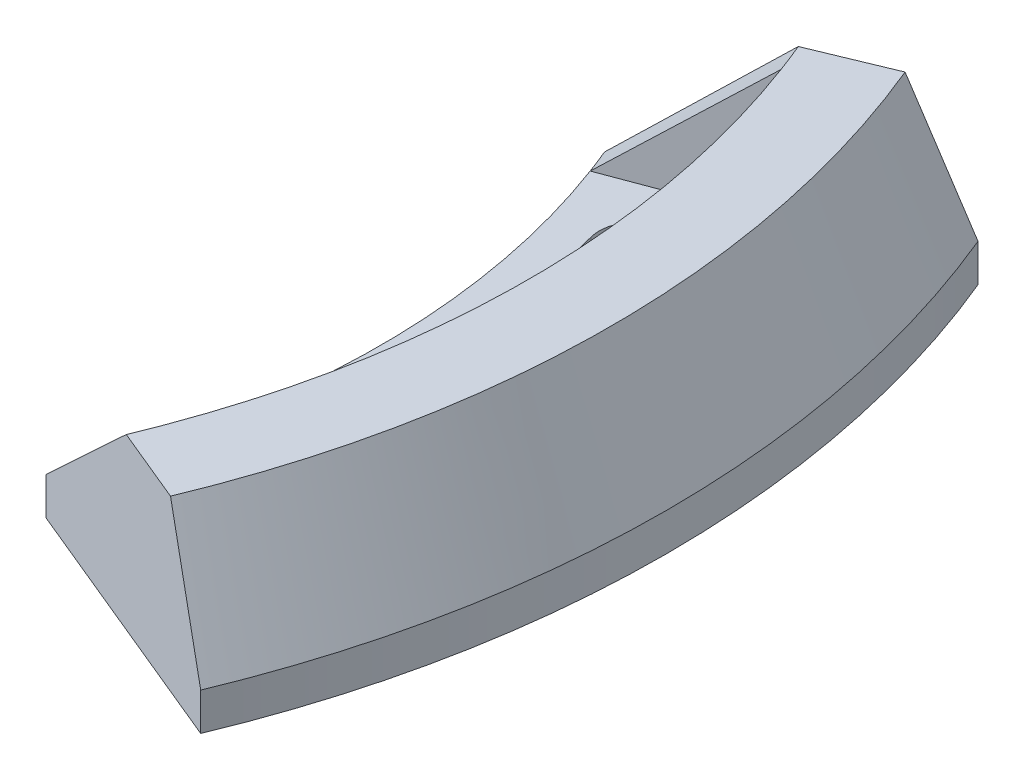
ISO-10303-21;
HEADER;
FILE_DESCRIPTION(('STEP AP214'),'2;1');
FILE_NAME('part.step','',(''),(''),'','','');
FILE_SCHEMA(('AUTOMOTIVE_DESIGN { 1 0 10303 214 1 1 1 1 }'));
ENDSEC;
DATA;
#1=APPLICATION_CONTEXT('core data for automotive mechanical design processes');
#2=APPLICATION_PROTOCOL_DEFINITION('international standard','automotive_design',2000,#1);
#3=PRODUCT_CONTEXT('',#1,'mechanical');
#4=PRODUCT('Part','Part','',(#3));
#5=PRODUCT_RELATED_PRODUCT_CATEGORY('part','',(#4));
#6=PRODUCT_DEFINITION_FORMATION('','',#4);
#7=PRODUCT_DEFINITION_CONTEXT('part definition',#1,'design');
#8=PRODUCT_DEFINITION('design','',#6,#7);
#9=PRODUCT_DEFINITION_SHAPE('','',#8);
#10=(LENGTH_UNIT() NAMED_UNIT(*) SI_UNIT(.MILLI.,.METRE.));
#11=(NAMED_UNIT(*) PLANE_ANGLE_UNIT() SI_UNIT($,.RADIAN.));
#12=(NAMED_UNIT(*) SI_UNIT($,.STERADIAN.) SOLID_ANGLE_UNIT());
#13=UNCERTAINTY_MEASURE_WITH_UNIT(LENGTH_MEASURE(1.E-05),#10,'distance_accuracy_value','');
#14=(GEOMETRIC_REPRESENTATION_CONTEXT(3) GLOBAL_UNCERTAINTY_ASSIGNED_CONTEXT((#13)) GLOBAL_UNIT_ASSIGNED_CONTEXT((#10,
#11,#12)) REPRESENTATION_CONTEXT('',''));
#15=CARTESIAN_POINT('',(0.,0.,0.));
#16=DIRECTION('',(0.,0.,1.));
#17=DIRECTION('',(1.,0.,0.));
#18=AXIS2_PLACEMENT_3D('',#15,#16,#17);
#19=CARTESIAN_POINT('',(89.6163146535948,5.,-37.1202929394138));
#20=DIRECTION('',(0.,1.,0.));
#21=DIRECTION('',(0.,0.,1.));
#22=AXIS2_PLACEMENT_3D('',#19,#20,#21);
#23=PLANE('',#22);
#24=CARTESIAN_POINT('',(103.35406341293,5.,27.6936378259698));
#25=DIRECTION('',(0.,1.,0.));
#26=DIRECTION('',(0.,0.,1.));
#27=AXIS2_PLACEMENT_3D('',#24,#25,#26);
#28=CIRCLE('',#27,5.);
#29=CARTESIAN_POINT('',(98.524434281485,5.,26.3995426004572));
#30=VERTEX_POINT('',#29);
#31=CARTESIAN_POINT('',(108.183692544376,5.,28.9877330514824));
#32=VERTEX_POINT('',#31);
#33=EDGE_CURVE('E55',#30,#32,#28,.T.);
#34=ORIENTED_EDGE('',*,*,#33,.F.);
#35=CARTESIAN_POINT('',(0.,5.,0.));
#36=DIRECTION('',(0.,1.,0.));
#37=DIRECTION('',(0.,0.,1.));
#38=AXIS2_PLACEMENT_3D('',#35,#36,#37);
#39=CIRCLE('',#38,102.);
#40=CARTESIAN_POINT('',(98.5244342814852,5.,-26.3995426004565));
#41=VERTEX_POINT('',#40);
#42=EDGE_CURVE('E155',#30,#41,#39,.T.);
#43=ORIENTED_EDGE('',*,*,#42,.T.);
#44=CARTESIAN_POINT('',(103.354063412931,5.,-27.6936378259691));
#45=DIRECTION('',(0.,1.,0.));
#46=DIRECTION('',(0.,0.,1.));
#47=AXIS2_PLACEMENT_3D('',#44,#45,#46);
#48=CIRCLE('',#47,4.99999999999999);
#49=CARTESIAN_POINT('',(108.183692544376,5.,-28.9877330514817));
#50=VERTEX_POINT('',#49);
#51=EDGE_CURVE('E159',#50,#41,#48,.T.);
#52=ORIENTED_EDGE('',*,*,#51,.F.);
#53=CARTESIAN_POINT('',(0.,5.,0.));
#54=DIRECTION('',(0.,1.,0.));
#55=DIRECTION('',(0.,0.,1.));
#56=AXIS2_PLACEMENT_3D('',#53,#54,#55);
#57=CIRCLE('',#56,112.);
#58=EDGE_CURVE('E168',#32,#50,#57,.T.);
#59=ORIENTED_EDGE('',*,*,#58,.F.);
#60=EDGE_LOOP('',(#34,#43,#52,#59));
#61=FACE_BOUND('',#60,.T.);
#62=CARTESIAN_POINT('',(0.,5.00000000000001,0.));
#63=DIRECTION('',(0.,-1.,0.));
#64=DIRECTION('',(0.,0.,-1.));
#65=AXIS2_PLACEMENT_3D('',#62,#63,#64);
#66=CIRCLE('',#65,124.136396225947);
#67=CARTESIAN_POINT('',(116.275110018364,5.00000000000001,-43.4734822412766));
#68=VERTEX_POINT('',#67);
#69=CARTESIAN_POINT('',(116.275110018364,5.00000000000001,43.4734822412766));
#70=VERTEX_POINT('',#69);
#71=EDGE_CURVE('E274',#68,#70,#66,.T.);
#72=ORIENTED_EDGE('',*,*,#71,.F.);
#73=DIRECTION('',(0.936672189248397,0.,-0.350207381259468));
#74=VECTOR('',#73,1.);
#75=CARTESIAN_POINT('',(116.275110018364,5.00000000000001,-43.4734822412766));
#76=LINE('',#75,#74);
#77=CARTESIAN_POINT('',(90.8572023570946,4.99999999999999,-33.9701159821684));
#78=VERTEX_POINT('',#77);
#79=EDGE_CURVE('E186',#78,#68,#76,.T.);
#80=ORIENTED_EDGE('',*,*,#79,.F.);
#81=CARTESIAN_POINT('',(0.,4.99999999999999,0.));
#82=DIRECTION('',(0.,-1.,0.));
#83=DIRECTION('',(0.,0.,-1.));
#84=AXIS2_PLACEMENT_3D('',#81,#82,#83);
#85=CIRCLE('',#84,97.);
#86=CARTESIAN_POINT('',(90.8572023570946,4.99999999999999,33.9701159821684));
#87=VERTEX_POINT('',#86);
#88=EDGE_CURVE('E276',#78,#87,#85,.T.);
#89=ORIENTED_EDGE('',*,*,#88,.T.);
#90=DIRECTION('',(0.936672189248397,0.,0.350207381259468));
#91=VECTOR('',#90,1.);
#92=CARTESIAN_POINT('',(116.275110018364,5.00000000000001,43.4734822412766));
#93=LINE('',#92,#91);
#94=EDGE_CURVE('E202',#87,#70,#93,.T.);
#95=ORIENTED_EDGE('',*,*,#94,.T.);
#96=EDGE_LOOP('',(#72,#80,#89,#95));
#97=FACE_BOUND('',#96,.T.);
#98=ADVANCED_FACE('F39',(#61,#97),#23,.T.);
#99=CARTESIAN_POINT('',(0.,22.4778342409335,0.));
#100=DIRECTION('',(0.,-1.,0.));
#101=DIRECTION('',(0.,0.,-1.));
#102=AXIS2_PLACEMENT_3D('',#99,#100,#101);
#103=CONICAL_SURFACE('',#102,116.717495748785,0.401425727958701);
#104=CARTESIAN_POINT('',(0.,22.4778342409335,0.));
#105=DIRECTION('',(0.,-1.,0.));
#106=DIRECTION('',(0.,0.,-1.));
#107=AXIS2_PLACEMENT_3D('',#104,#105,#106);
#108=CIRCLE('',#107,116.717495748785);
#109=CARTESIAN_POINT('',(109.326032266605,22.4778342409335,-40.875328533345));
#110=VERTEX_POINT('',#109);
#111=CARTESIAN_POINT('',(109.326032266605,22.4778342409335,40.875328533345));
#112=VERTEX_POINT('',#111);
#113=EDGE_CURVE('E269',#110,#112,#108,.T.);
#114=ORIENTED_EDGE('',*,*,#113,.F.);
#115=DIRECTION('',(-0.365986981529549,0.920504853452439,0.136836925284787));
#116=VECTOR('',#115,1.);
#117=CARTESIAN_POINT('',(109.326032266605,22.4778342409335,-40.875328533345));
#118=LINE('',#117,#116);
#119=EDGE_CURVE('E190',#68,#110,#118,.T.);
#120=ORIENTED_EDGE('',*,*,#119,.F.);
#121=ORIENTED_EDGE('',*,*,#71,.T.);
#122=DIRECTION('',(-0.365986981529549,0.920504853452439,-0.136836925284787));
#123=VECTOR('',#122,1.);
#124=CARTESIAN_POINT('',(109.326032266605,22.4778342409335,40.875328533345));
#125=LINE('',#124,#123);
#126=EDGE_CURVE('E206',#70,#112,#125,.T.);
#127=ORIENTED_EDGE('',*,*,#126,.T.);
#128=EDGE_LOOP('',(#114,#120,#121,#127));
#129=FACE_BOUND('',#128,.T.);
#130=ADVANCED_FACE('F316',(#129),#103,.F.);
#131=CARTESIAN_POINT('',(124.723736889024,0.,-51.6622633692872));
#132=DIRECTION('',(0.,-1.,0.));
#133=DIRECTION('',(0.,0.,-1.));
#134=AXIS2_PLACEMENT_3D('',#131,#132,#133);
#135=PLANE('',#134);
#136=CARTESIAN_POINT('',(103.35406341293,0.,27.6936378259698));
#137=DIRECTION('',(0.,1.,0.));
#138=DIRECTION('',(0.,0.,1.));
#139=AXIS2_PLACEMENT_3D('',#136,#137,#138);
#140=CIRCLE('',#139,5.);
#141=CARTESIAN_POINT('',(98.524434281485,0.,26.3995426004572));
#142=VERTEX_POINT('',#141);
#143=CARTESIAN_POINT('',(108.183692544376,0.,28.9877330514824));
#144=VERTEX_POINT('',#143);
#145=EDGE_CURVE('E137',#142,#144,#140,.T.);
#146=ORIENTED_EDGE('',*,*,#145,.T.);
#147=CARTESIAN_POINT('',(0.,0.,0.));
#148=DIRECTION('',(0.,1.,0.));
#149=DIRECTION('',(0.,0.,1.));
#150=AXIS2_PLACEMENT_3D('',#147,#148,#149);
#151=CIRCLE('',#150,112.);
#152=CARTESIAN_POINT('',(108.183692544376,0.,-28.9877330514817));
#153=VERTEX_POINT('',#152);
#154=EDGE_CURVE('E147',#144,#153,#151,.T.);
#155=ORIENTED_EDGE('',*,*,#154,.T.);
#156=CARTESIAN_POINT('',(103.354063412931,0.,-27.6936378259691));
#157=DIRECTION('',(0.,1.,0.));
#158=DIRECTION('',(0.,0.,1.));
#159=AXIS2_PLACEMENT_3D('',#156,#157,#158);
#160=CIRCLE('',#159,4.99999999999999);
#161=CARTESIAN_POINT('',(98.5244342814852,0.,-26.3995426004565));
#162=VERTEX_POINT('',#161);
#163=EDGE_CURVE('E63',#153,#162,#160,.T.);
#164=ORIENTED_EDGE('',*,*,#163,.T.);
#165=CARTESIAN_POINT('',(0.,0.,0.));
#166=DIRECTION('',(0.,1.,0.));
#167=DIRECTION('',(0.,0.,1.));
#168=AXIS2_PLACEMENT_3D('',#165,#166,#167);
#169=CIRCLE('',#168,102.);
#170=EDGE_CURVE('E144',#142,#162,#169,.T.);
#171=ORIENTED_EDGE('',*,*,#170,.F.);
#172=EDGE_LOOP('',(#146,#155,#164,#171));
#173=FACE_BOUND('',#172,.T.);
#174=CARTESIAN_POINT('',(0.,0.,0.));
#175=DIRECTION('',(0.,-1.,0.));
#176=DIRECTION('',(0.,0.,-1.));
#177=AXIS2_PLACEMENT_3D('',#174,#175,#176);
#178=CIRCLE('',#177,97.);
#179=CARTESIAN_POINT('',(89.6163146535948,0.,-37.1202929394138));
#180=VERTEX_POINT('',#179);
#181=CARTESIAN_POINT('',(89.6163146535948,0.,37.1202929394138));
#182=VERTEX_POINT('',#181);
#183=EDGE_CURVE('E11',#180,#182,#178,.T.);
#184=ORIENTED_EDGE('',*,*,#183,.F.);
#185=DIRECTION('',(0.923879532511287,0.,-0.382683432365091));
#186=VECTOR('',#185,1.);
#187=CARTESIAN_POINT('',(124.723736889024,0.,-51.6622633692872));
#188=LINE('',#187,#186);
#189=CARTESIAN_POINT('',(124.723736889024,0.,-51.6622633692872));
#190=VERTEX_POINT('',#189);
#191=EDGE_CURVE('E241',#180,#190,#188,.T.);
#192=ORIENTED_EDGE('',*,*,#191,.T.);
#193=CARTESIAN_POINT('',(0.,0.,0.));
#194=DIRECTION('',(0.,-1.,0.));
#195=DIRECTION('',(0.,0.,-1.));
#196=AXIS2_PLACEMENT_3D('',#193,#194,#195);
#197=CIRCLE('',#196,135.);
#198=CARTESIAN_POINT('',(124.723736889024,0.,51.6622633692872));
#199=VERTEX_POINT('',#198);
#200=EDGE_CURVE('E260',#190,#199,#197,.T.);
#201=ORIENTED_EDGE('',*,*,#200,.T.);
#202=DIRECTION('',(0.923879532511287,0.,0.382683432365091));
#203=VECTOR('',#202,1.);
#204=CARTESIAN_POINT('',(124.723736889024,0.,51.6622633692872));
#205=LINE('',#204,#203);
#206=EDGE_CURVE('E221',#182,#199,#205,.T.);
#207=ORIENTED_EDGE('',*,*,#206,.F.);
#208=EDGE_LOOP('',(#184,#192,#201,#207));
#209=FACE_BOUND('',#208,.T.);
#210=ADVANCED_FACE('F152',(#173,#209),#135,.T.);
#211=CARTESIAN_POINT('',(0.,0.,0.));
#212=DIRECTION('',(0.,-1.,0.));
#213=DIRECTION('',(0.,0.,-1.));
#214=AXIS2_PLACEMENT_3D('',#211,#212,#213);
#215=CYLINDRICAL_SURFACE('',#214,97.);
#216=CARTESIAN_POINT('',(89.6163146535948,4.99999999999999,-37.1202929394138));
#217=VERTEX_POINT('',#216);
#218=EDGE_CURVE('E48',#217,#78,#85,.T.);
#219=ORIENTED_EDGE('',*,*,#218,.F.);
#220=DIRECTION('',(0.,-1.,0.));
#221=VECTOR('',#220,1.);
#222=CARTESIAN_POINT('',(89.6163146535948,0.,-37.1202929394138));
#223=LINE('',#222,#221);
#224=EDGE_CURVE('E256',#217,#180,#223,.T.);
#225=ORIENTED_EDGE('',*,*,#224,.T.);
#226=ORIENTED_EDGE('',*,*,#183,.T.);
#227=DIRECTION('',(0.,-1.,0.));
#228=VECTOR('',#227,1.);
#229=CARTESIAN_POINT('',(89.6163146535948,0.,37.1202929394138));
#230=LINE('',#229,#228);
#231=CARTESIAN_POINT('',(89.6163146535948,4.99999999999999,37.1202929394138));
#232=VERTEX_POINT('',#231);
#233=EDGE_CURVE('E237',#232,#182,#230,.T.);
#234=ORIENTED_EDGE('',*,*,#233,.F.);
#235=CARTESIAN_POINT('',(0.,4.99999999999999,0.));
#236=DIRECTION('',(0.,-1.,0.));
#237=DIRECTION('',(0.,0.,-1.));
#238=AXIS2_PLACEMENT_3D('',#235,#236,#237);
#239=CIRCLE('',#238,97.);
#240=EDGE_CURVE('E218',#87,#232,#239,.T.);
#241=ORIENTED_EDGE('',*,*,#240,.F.);
#242=ORIENTED_EDGE('',*,*,#88,.F.);
#243=EDGE_LOOP('',(#219,#225,#226,#234,#241,#242));
#244=FACE_BOUND('',#243,.T.);
#245=ADVANCED_FACE('F41',(#244),#215,.F.);
#246=CARTESIAN_POINT('',(107.832905408275,22.4778342409335,-44.6658518902028));
#247=DIRECTION('',(0.,1.,0.));
#248=DIRECTION('',(0.,0.,1.));
#249=AXIS2_PLACEMENT_3D('',#246,#247,#248);
#250=PLANE('',#249);
#251=CARTESIAN_POINT('',(0.,22.4778342409335,0.));
#252=DIRECTION('',(0.,-1.,0.));
#253=DIRECTION('',(0.,0.,-1.));
#254=AXIS2_PLACEMENT_3D('',#251,#252,#253);
#255=CIRCLE('',#254,127.581099522838);
#256=CARTESIAN_POINT('',(117.869566584435,22.4778342409335,-48.8231730703118));
#257=VERTEX_POINT('',#256);
#258=CARTESIAN_POINT('',(117.869566584435,22.4778342409335,48.8231730703118));
#259=VERTEX_POINT('',#258);
#260=EDGE_CURVE('E266',#257,#259,#255,.T.);
#261=ORIENTED_EDGE('',*,*,#260,.F.);
#262=DIRECTION('',(-0.923879532511287,0.,0.382683432365091));
#263=VECTOR('',#262,1.);
#264=CARTESIAN_POINT('',(107.832905408275,22.4778342409335,-44.6658518902028));
#265=LINE('',#264,#263);
#266=CARTESIAN_POINT('',(107.832905408275,22.4778342409335,-44.6658518902028));
#267=VERTEX_POINT('',#266);
#268=EDGE_CURVE('E253',#257,#267,#265,.T.);
#269=ORIENTED_EDGE('',*,*,#268,.T.);
#270=EDGE_CURVE('E270',#267,#110,#108,.T.);
#271=ORIENTED_EDGE('',*,*,#270,.T.);
#272=ORIENTED_EDGE('',*,*,#113,.T.);
#273=CARTESIAN_POINT('',(0.,22.4778342409335,0.));
#274=DIRECTION('',(0.,-1.,0.));
#275=DIRECTION('',(0.,0.,-1.));
#276=AXIS2_PLACEMENT_3D('',#273,#274,#275);
#277=CIRCLE('',#276,116.717495748785);
#278=CARTESIAN_POINT('',(107.832905408275,22.4778342409335,44.6658518902028));
#279=VERTEX_POINT('',#278);
#280=EDGE_CURVE('E214',#112,#279,#277,.T.);
#281=ORIENTED_EDGE('',*,*,#280,.T.);
#282=DIRECTION('',(-0.923879532511287,0.,-0.382683432365091));
#283=VECTOR('',#282,1.);
#284=CARTESIAN_POINT('',(107.832905408275,22.4778342409335,44.6658518902028));
#285=LINE('',#284,#283);
#286=EDGE_CURVE('E233',#259,#279,#285,.T.);
#287=ORIENTED_EDGE('',*,*,#286,.F.);
#288=EDGE_LOOP('',(#261,#269,#271,#272,#281,#287));
#289=FACE_BOUND('',#288,.T.);
#290=ADVANCED_FACE('F311',(#289),#250,.T.);
#291=CARTESIAN_POINT('',(0.,5.00000000000001,0.));
#292=DIRECTION('',(0.,-1.,0.));
#293=DIRECTION('',(0.,0.,-1.));
#294=AXIS2_PLACEMENT_3D('',#291,#292,#293);
#295=CONICAL_SURFACE('',#294,135.,0.401425727958701);
#296=CARTESIAN_POINT('',(0.,5.00000000000001,0.));
#297=DIRECTION('',(0.,-1.,0.));
#298=DIRECTION('',(0.,0.,-1.));
#299=AXIS2_PLACEMENT_3D('',#296,#297,#298);
#300=CIRCLE('',#299,135.);
#301=CARTESIAN_POINT('',(124.723736889024,5.00000000000001,-51.6622633692872));
#302=VERTEX_POINT('',#301);
#303=CARTESIAN_POINT('',(124.723736889024,5.00000000000001,51.6622633692872));
#304=VERTEX_POINT('',#303);
#305=EDGE_CURVE('E263',#302,#304,#300,.T.);
#306=ORIENTED_EDGE('',*,*,#305,.F.);
#307=DIRECTION('',(-0.360988492326281,0.920504853452439,0.149526329382162));
#308=VECTOR('',#307,1.);
#309=CARTESIAN_POINT('',(117.869566584435,22.4778342409335,-48.8231730703118));
#310=LINE('',#309,#308);
#311=EDGE_CURVE('E249',#302,#257,#310,.T.);
#312=ORIENTED_EDGE('',*,*,#311,.T.);
#313=ORIENTED_EDGE('',*,*,#260,.T.);
#314=DIRECTION('',(-0.360988492326281,0.920504853452439,-0.149526329382162));
#315=VECTOR('',#314,1.);
#316=CARTESIAN_POINT('',(117.869566584435,22.4778342409335,48.8231730703118));
#317=LINE('',#316,#315);
#318=EDGE_CURVE('E229',#304,#259,#317,.T.);
#319=ORIENTED_EDGE('',*,*,#318,.F.);
#320=EDGE_LOOP('',(#306,#312,#313,#319));
#321=FACE_BOUND('',#320,.T.);
#322=ADVANCED_FACE('F307',(#321),#295,.T.);
#323=CARTESIAN_POINT('',(0.,0.,0.));
#324=DIRECTION('',(0.,-1.,0.));
#325=DIRECTION('',(0.,0.,-1.));
#326=AXIS2_PLACEMENT_3D('',#323,#324,#325);
#327=CYLINDRICAL_SURFACE('',#326,135.);
#328=DIRECTION('',(0.,1.,0.));
#329=VECTOR('',#328,1.);
#330=CARTESIAN_POINT('',(124.723736889024,5.00000000000001,-51.6622633692872));
#331=LINE('',#330,#329);
#332=EDGE_CURVE('E245',#190,#302,#331,.T.);
#333=ORIENTED_EDGE('',*,*,#332,.T.);
#334=ORIENTED_EDGE('',*,*,#305,.T.);
#335=DIRECTION('',(0.,1.,0.));
#336=VECTOR('',#335,1.);
#337=CARTESIAN_POINT('',(124.723736889024,5.00000000000001,51.6622633692872));
#338=LINE('',#337,#336);
#339=EDGE_CURVE('E225',#199,#304,#338,.T.);
#340=ORIENTED_EDGE('',*,*,#339,.F.);
#341=ORIENTED_EDGE('',*,*,#200,.F.);
#342=EDGE_LOOP('',(#333,#334,#340,#341));
#343=FACE_BOUND('',#342,.T.);
#344=ADVANCED_FACE('F303',(#343),#327,.T.);
#345=CARTESIAN_POINT('',(0.,0.,0.));
#346=DIRECTION('',(-0.382683432365091,0.,-0.923879532511287));
#347=DIRECTION('',(-0.923879532511287,0.,0.382683432365091));
#348=AXIS2_PLACEMENT_3D('',#345,#346,#347);
#349=PLANE('',#348);
#350=ORIENTED_EDGE('',*,*,#224,.F.);
#351=DIRECTION('',(-0.691365658942044,-0.663327982144961,0.286373032492807));
#352=VECTOR('',#351,1.);
#353=CARTESIAN_POINT('',(89.6163146535948,4.99999999999999,-37.1202929394138));
#354=LINE('',#353,#352);
#355=EDGE_CURVE('E177',#267,#217,#354,.T.);
#356=ORIENTED_EDGE('',*,*,#355,.F.);
#357=ORIENTED_EDGE('',*,*,#268,.F.);
#358=ORIENTED_EDGE('',*,*,#311,.F.);
#359=ORIENTED_EDGE('',*,*,#332,.F.);
#360=ORIENTED_EDGE('',*,*,#191,.F.);
#361=EDGE_LOOP('',(#350,#356,#357,#358,#359,#360));
#362=FACE_BOUND('',#361,.T.);
#363=ADVANCED_FACE('F322',(#362),#349,.T.);
#364=CARTESIAN_POINT('',(0.,0.,0.));
#365=DIRECTION('',(0.382683432365091,0.,-0.923879532511287));
#366=DIRECTION('',(-0.923879532511287,0.,-0.382683432365091));
#367=AXIS2_PLACEMENT_3D('',#364,#365,#366);
#368=PLANE('',#367);
#369=DIRECTION('',(-0.691365658942044,-0.663327982144961,-0.286373032492807));
#370=VECTOR('',#369,1.);
#371=CARTESIAN_POINT('',(89.6163146535948,4.99999999999999,37.1202929394138));
#372=LINE('',#371,#370);
#373=EDGE_CURVE('E198',#279,#232,#372,.T.);
#374=ORIENTED_EDGE('',*,*,#373,.T.);
#375=ORIENTED_EDGE('',*,*,#233,.T.);
#376=ORIENTED_EDGE('',*,*,#206,.T.);
#377=ORIENTED_EDGE('',*,*,#339,.T.);
#378=ORIENTED_EDGE('',*,*,#318,.T.);
#379=ORIENTED_EDGE('',*,*,#286,.T.);
#380=EDGE_LOOP('',(#374,#375,#376,#377,#378,#379));
#381=FACE_BOUND('',#380,.T.);
#382=ADVANCED_FACE('F298',(#381),#368,.F.);
#383=CARTESIAN_POINT('',(0.,22.4778342409335,0.));
#384=DIRECTION('',(0.,1.,0.));
#385=DIRECTION('',(0.,0.,1.));
#386=AXIS2_PLACEMENT_3D('',#383,#384,#385);
#387=CONICAL_SURFACE('',#386,116.717495748785,0.845539063498899);
#388=ORIENTED_EDGE('',*,*,#280,.F.);
#389=DIRECTION('',(-0.70093877236586,-0.663327982144961,-0.262070268244482));
#390=VECTOR('',#389,1.);
#391=CARTESIAN_POINT('',(90.8572023570946,4.99999999999999,33.9701159821684));
#392=LINE('',#391,#390);
#393=EDGE_CURVE('E210',#112,#87,#392,.T.);
#394=ORIENTED_EDGE('',*,*,#393,.T.);
#395=ORIENTED_EDGE('',*,*,#240,.T.);
#396=ORIENTED_EDGE('',*,*,#373,.F.);
#397=EDGE_LOOP('',(#388,#394,#395,#396));
#398=FACE_BOUND('',#397,.T.);
#399=ADVANCED_FACE('F291',(#398),#387,.F.);
#400=CARTESIAN_POINT('',(0.,0.,0.));
#401=DIRECTION('',(-0.350207381259468,0.,0.936672189248397));
#402=DIRECTION('',(0.936672189248397,0.,0.350207381259468));
#403=AXIS2_PLACEMENT_3D('',#400,#401,#402);
#404=PLANE('',#403);
#405=ORIENTED_EDGE('',*,*,#94,.F.);
#406=ORIENTED_EDGE('',*,*,#393,.F.);
#407=ORIENTED_EDGE('',*,*,#126,.F.);
#408=EDGE_LOOP('',(#405,#406,#407));
#409=FACE_BOUND('',#408,.T.);
#410=ADVANCED_FACE('F294',(#409),#404,.F.);
#411=CARTESIAN_POINT('',(0.,22.4778342409335,0.));
#412=DIRECTION('',(0.,1.,0.));
#413=DIRECTION('',(0.,0.,-1.));
#414=AXIS2_PLACEMENT_3D('',#411,#412,#413);
#415=CONICAL_SURFACE('',#414,116.717495748785,0.845539063498899);
#416=ORIENTED_EDGE('',*,*,#270,.F.);
#417=ORIENTED_EDGE('',*,*,#355,.T.);
#418=ORIENTED_EDGE('',*,*,#218,.T.);
#419=DIRECTION('',(-0.70093877236586,-0.663327982144961,0.262070268244482));
#420=VECTOR('',#419,1.);
#421=CARTESIAN_POINT('',(90.8572023570946,4.99999999999999,-33.9701159821684));
#422=LINE('',#421,#420);
#423=EDGE_CURVE('E194',#110,#78,#422,.T.);
#424=ORIENTED_EDGE('',*,*,#423,.F.);
#425=EDGE_LOOP('',(#416,#417,#418,#424));
#426=FACE_BOUND('',#425,.T.);
#427=ADVANCED_FACE('F319',(#426),#415,.F.);
#428=CARTESIAN_POINT('',(0.,0.,0.));
#429=DIRECTION('',(-0.350207381259468,0.,-0.936672189248397));
#430=DIRECTION('',(0.936672189248397,0.,-0.350207381259468));
#431=AXIS2_PLACEMENT_3D('',#428,#429,#430);
#432=PLANE('',#431);
#433=ORIENTED_EDGE('',*,*,#79,.T.);
#434=ORIENTED_EDGE('',*,*,#119,.T.);
#435=ORIENTED_EDGE('',*,*,#423,.T.);
#436=EDGE_LOOP('',(#433,#434,#435));
#437=FACE_BOUND('',#436,.T.);
#438=ADVANCED_FACE('F318',(#437),#432,.F.);
#439=CARTESIAN_POINT('',(103.35406341293,0.,27.6936378259698));
#440=DIRECTION('',(0.,1.,0.));
#441=DIRECTION('',(0.,0.,1.));
#442=AXIS2_PLACEMENT_3D('',#439,#440,#441);
#443=CYLINDRICAL_SURFACE('',#442,5.);
#444=ORIENTED_EDGE('',*,*,#33,.T.);
#445=DIRECTION('',(0.,1.,0.));
#446=VECTOR('',#445,1.);
#447=CARTESIAN_POINT('',(108.183692544376,0.,28.9877330514824));
#448=LINE('',#447,#446);
#449=EDGE_CURVE('E133',#144,#32,#448,.T.);
#450=ORIENTED_EDGE('',*,*,#449,.F.);
#451=ORIENTED_EDGE('',*,*,#145,.F.);
#452=DIRECTION('',(0.,1.,0.));
#453=VECTOR('',#452,1.);
#454=CARTESIAN_POINT('',(98.524434281485,0.,26.3995426004572));
#455=LINE('',#454,#453);
#456=EDGE_CURVE('E174',#142,#30,#455,.T.);
#457=ORIENTED_EDGE('',*,*,#456,.T.);
#458=EDGE_LOOP('',(#444,#450,#451,#457));
#459=FACE_BOUND('',#458,.T.);
#460=ADVANCED_FACE('F135',(#459),#443,.F.);
#461=CARTESIAN_POINT('',(0.,0.,0.));
#462=DIRECTION('',(0.,1.,0.));
#463=DIRECTION('',(0.,0.,1.));
#464=AXIS2_PLACEMENT_3D('',#461,#462,#463);
#465=CYLINDRICAL_SURFACE('',#464,102.);
#466=ORIENTED_EDGE('',*,*,#42,.F.);
#467=ORIENTED_EDGE('',*,*,#456,.F.);
#468=ORIENTED_EDGE('',*,*,#170,.T.);
#469=DIRECTION('',(0.,1.,0.));
#470=VECTOR('',#469,1.);
#471=CARTESIAN_POINT('',(98.5244342814852,0.,-26.3995426004565));
#472=LINE('',#471,#470);
#473=EDGE_CURVE('E178',#162,#41,#472,.T.);
#474=ORIENTED_EDGE('',*,*,#473,.T.);
#475=EDGE_LOOP('',(#466,#467,#468,#474));
#476=FACE_BOUND('',#475,.T.);
#477=ADVANCED_FACE('F424',(#476),#465,.T.);
#478=CARTESIAN_POINT('',(103.354063412931,0.,-27.6936378259691));
#479=DIRECTION('',(0.,1.,0.));
#480=DIRECTION('',(0.,0.,1.));
#481=AXIS2_PLACEMENT_3D('',#478,#479,#480);
#482=CYLINDRICAL_SURFACE('',#481,4.99999999999999);
#483=ORIENTED_EDGE('',*,*,#51,.T.);
#484=ORIENTED_EDGE('',*,*,#473,.F.);
#485=ORIENTED_EDGE('',*,*,#163,.F.);
#486=DIRECTION('',(0.,1.,0.));
#487=VECTOR('',#486,1.);
#488=CARTESIAN_POINT('',(108.183692544376,0.,-28.9877330514817));
#489=LINE('',#488,#487);
#490=EDGE_CURVE('E143',#153,#50,#489,.T.);
#491=ORIENTED_EDGE('',*,*,#490,.T.);
#492=EDGE_LOOP('',(#483,#484,#485,#491));
#493=FACE_BOUND('',#492,.T.);
#494=ADVANCED_FACE('F432',(#493),#482,.F.);
#495=CARTESIAN_POINT('',(0.,0.,0.));
#496=DIRECTION('',(0.,1.,0.));
#497=DIRECTION('',(0.,0.,1.));
#498=AXIS2_PLACEMENT_3D('',#495,#496,#497);
#499=CYLINDRICAL_SURFACE('',#498,112.);
#500=ORIENTED_EDGE('',*,*,#58,.T.);
#501=ORIENTED_EDGE('',*,*,#490,.F.);
#502=ORIENTED_EDGE('',*,*,#154,.F.);
#503=ORIENTED_EDGE('',*,*,#449,.T.);
#504=EDGE_LOOP('',(#500,#501,#502,#503));
#505=FACE_BOUND('',#504,.T.);
#506=ADVANCED_FACE('F148',(#505),#499,.F.);
#507=CLOSED_SHELL('',(#98,#130,#210,#245,#290,#322,#344,#363,#382,#399,#410,#427,#438,#460,#477,
#494,#506));
#508=MANIFOLD_SOLID_BREP('B2',#507);
#509=ADVANCED_BREP_SHAPE_REPRESENTATION('',(#18,#508),#14);
#510=SHAPE_DEFINITION_REPRESENTATION(#9,#509);
ENDSEC;
END-ISO-10303-21;
